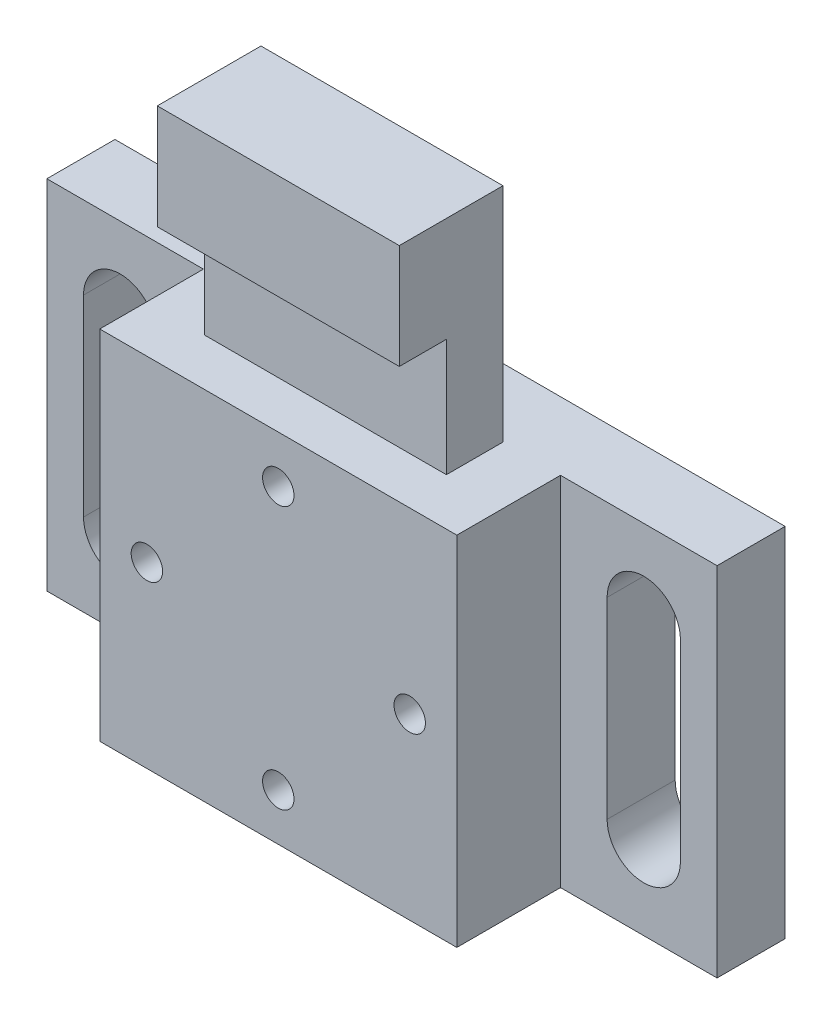
ISO-10303-21;
HEADER;
FILE_DESCRIPTION(('STEP AP214'),'2;1');
FILE_NAME('part.step','',(''),(''),'','','');
FILE_SCHEMA(('AUTOMOTIVE_DESIGN { 1 0 10303 214 1 1 1 1 }'));
ENDSEC;
DATA;
#1=APPLICATION_CONTEXT('core data for automotive mechanical design processes');
#2=APPLICATION_PROTOCOL_DEFINITION('international standard','automotive_design',2000,#1);
#3=PRODUCT_CONTEXT('',#1,'mechanical');
#4=PRODUCT('Part','Part','',(#3));
#5=PRODUCT_RELATED_PRODUCT_CATEGORY('part','',(#4));
#6=PRODUCT_DEFINITION_FORMATION('','',#4);
#7=PRODUCT_DEFINITION_CONTEXT('part definition',#1,'design');
#8=PRODUCT_DEFINITION('design','',#6,#7);
#9=PRODUCT_DEFINITION_SHAPE('','',#8);
#10=(LENGTH_UNIT() NAMED_UNIT(*) SI_UNIT(.MILLI.,.METRE.));
#11=(NAMED_UNIT(*) PLANE_ANGLE_UNIT() SI_UNIT($,.RADIAN.));
#12=(NAMED_UNIT(*) SI_UNIT($,.STERADIAN.) SOLID_ANGLE_UNIT());
#13=UNCERTAINTY_MEASURE_WITH_UNIT(LENGTH_MEASURE(1.E-05),#10,'distance_accuracy_value','');
#14=(GEOMETRIC_REPRESENTATION_CONTEXT(3) GLOBAL_UNCERTAINTY_ASSIGNED_CONTEXT((#13)) GLOBAL_UNIT_ASSIGNED_CONTEXT((#10,
#11,#12)) REPRESENTATION_CONTEXT('',''));
#15=CARTESIAN_POINT('',(0.,0.,0.));
#16=DIRECTION('',(0.,0.,1.));
#17=DIRECTION('',(1.,0.,0.));
#18=AXIS2_PLACEMENT_3D('',#15,#16,#17);
#19=CARTESIAN_POINT('',(0.,0.,16.4));
#20=DIRECTION('',(0.,0.,1.));
#21=DIRECTION('',(1.,0.,0.));
#22=AXIS2_PLACEMENT_3D('',#19,#20,#21);
#23=PLANE('',#22);
#24=CARTESIAN_POINT('',(-12.55,0.,16.4));
#25=DIRECTION('',(0.,0.,1.));
#26=DIRECTION('',(1.,0.,0.));
#27=AXIS2_PLACEMENT_3D('',#24,#25,#26);
#28=CIRCLE('',#27,1.5);
#29=CARTESIAN_POINT('',(-11.05,0.,16.4));
#30=VERTEX_POINT('',#29);
#31=EDGE_CURVE('E627',#30,#30,#28,.T.);
#32=ORIENTED_EDGE('',*,*,#31,.F.);
#33=EDGE_LOOP('',(#32));
#34=FACE_BOUND('',#33,.T.);
#35=DIRECTION('',(-1.,0.,0.));
#36=VECTOR('',#35,1.);
#37=CARTESIAN_POINT('',(11.555,17.05,16.4));
#38=LINE('',#37,#36);
#39=CARTESIAN_POINT('',(17.05,17.05,16.4));
#40=VERTEX_POINT('',#39);
#41=CARTESIAN_POINT('',(-17.05,17.05,16.4));
#42=VERTEX_POINT('',#41);
#43=EDGE_CURVE('E281',#40,#42,#38,.T.);
#44=ORIENTED_EDGE('',*,*,#43,.T.);
#45=DIRECTION('',(0.,-1.,0.));
#46=VECTOR('',#45,1.);
#47=CARTESIAN_POINT('',(-17.05,17.05,16.4));
#48=LINE('',#47,#46);
#49=CARTESIAN_POINT('',(-17.05,-17.05,16.4));
#50=VERTEX_POINT('',#49);
#51=EDGE_CURVE('E273',#42,#50,#48,.T.);
#52=ORIENTED_EDGE('',*,*,#51,.T.);
#53=DIRECTION('',(1.,0.,0.));
#54=VECTOR('',#53,1.);
#55=CARTESIAN_POINT('',(-17.05,-17.05,16.4));
#56=LINE('',#55,#54);
#57=CARTESIAN_POINT('',(17.05,-17.05,16.4));
#58=VERTEX_POINT('',#57);
#59=EDGE_CURVE('E276',#50,#58,#56,.T.);
#60=ORIENTED_EDGE('',*,*,#59,.T.);
#61=DIRECTION('',(0.,1.,0.));
#62=VECTOR('',#61,1.);
#63=CARTESIAN_POINT('',(17.05,17.05,16.4));
#64=LINE('',#63,#62);
#65=EDGE_CURVE('E279',#58,#40,#64,.T.);
#66=ORIENTED_EDGE('',*,*,#65,.T.);
#67=EDGE_LOOP('',(#44,#52,#60,#66));
#68=FACE_BOUND('',#67,.T.);
#69=CARTESIAN_POINT('',(0.,12.55,16.4));
#70=DIRECTION('',(0.,0.,1.));
#71=DIRECTION('',(1.,0.,0.));
#72=AXIS2_PLACEMENT_3D('',#69,#70,#71);
#73=CIRCLE('',#72,1.5);
#74=CARTESIAN_POINT('',(1.5,12.55,16.4));
#75=VERTEX_POINT('',#74);
#76=EDGE_CURVE('E643',#75,#75,#73,.T.);
#77=ORIENTED_EDGE('',*,*,#76,.F.);
#78=EDGE_LOOP('',(#77));
#79=FACE_BOUND('',#78,.T.);
#80=CARTESIAN_POINT('',(0.,-12.55,16.4));
#81=DIRECTION('',(0.,0.,1.));
#82=DIRECTION('',(1.,0.,0.));
#83=AXIS2_PLACEMENT_3D('',#80,#81,#82);
#84=CIRCLE('',#83,1.5);
#85=CARTESIAN_POINT('',(1.5,-12.55,16.4));
#86=VERTEX_POINT('',#85);
#87=EDGE_CURVE('E638',#86,#86,#84,.T.);
#88=ORIENTED_EDGE('',*,*,#87,.F.);
#89=EDGE_LOOP('',(#88));
#90=FACE_BOUND('',#89,.T.);
#91=CARTESIAN_POINT('',(12.55,0.,16.4));
#92=DIRECTION('',(0.,0.,-1.));
#93=DIRECTION('',(-1.,0.,0.));
#94=AXIS2_PLACEMENT_3D('',#91,#92,#93);
#95=CIRCLE('',#94,1.5);
#96=CARTESIAN_POINT('',(11.05,0.,16.4));
#97=VERTEX_POINT('',#96);
#98=EDGE_CURVE('E630',#97,#97,#95,.T.);
#99=ORIENTED_EDGE('',*,*,#98,.T.);
#100=EDGE_LOOP('',(#99));
#101=FACE_BOUND('',#100,.T.);
#102=ADVANCED_FACE('F36',(#34,#68,#79,#90,#101),#23,.T.);
#103=CARTESIAN_POINT('',(0.,0.,6.5));
#104=DIRECTION('',(0.,0.,1.));
#105=DIRECTION('',(1.,0.,0.));
#106=AXIS2_PLACEMENT_3D('',#103,#104,#105);
#107=PLANE('',#106);
#108=DIRECTION('',(0.,1.,0.));
#109=VECTOR('',#108,1.);
#110=CARTESIAN_POINT('',(17.05,17.05,6.5));
#111=LINE('',#110,#109);
#112=CARTESIAN_POINT('',(17.05,-17.05,6.5));
#113=VERTEX_POINT('',#112);
#114=CARTESIAN_POINT('',(17.05,17.05,6.5));
#115=VERTEX_POINT('',#114);
#116=EDGE_CURVE('E293',#113,#115,#111,.T.);
#117=ORIENTED_EDGE('',*,*,#116,.F.);
#118=DIRECTION('',(1.,0.,0.));
#119=VECTOR('',#118,1.);
#120=CARTESIAN_POINT('',(-32.,-17.05,6.5));
#121=LINE('',#120,#119);
#122=CARTESIAN_POINT('',(32.,-17.05,6.5));
#123=VERTEX_POINT('',#122);
#124=EDGE_CURVE('E327',#113,#123,#121,.T.);
#125=ORIENTED_EDGE('',*,*,#124,.T.);
#126=DIRECTION('',(0.,1.,0.));
#127=VECTOR('',#126,1.);
#128=CARTESIAN_POINT('',(32.,17.05,6.5));
#129=LINE('',#128,#127);
#130=CARTESIAN_POINT('',(32.,17.05,6.5));
#131=VERTEX_POINT('',#130);
#132=EDGE_CURVE('E331',#123,#131,#129,.T.);
#133=ORIENTED_EDGE('',*,*,#132,.T.);
#134=DIRECTION('',(-1.,0.,0.));
#135=VECTOR('',#134,1.);
#136=CARTESIAN_POINT('',(-32.,17.05,6.5));
#137=LINE('',#136,#135);
#138=EDGE_CURVE('E334',#131,#115,#137,.T.);
#139=ORIENTED_EDGE('',*,*,#138,.T.);
#140=EDGE_LOOP('',(#117,#125,#133,#139));
#141=FACE_BOUND('',#140,.T.);
#142=DIRECTION('',(0.,1.,0.));
#143=VECTOR('',#142,1.);
#144=CARTESIAN_POINT('',(21.5,9.17868157946697,6.5));
#145=LINE('',#144,#143);
#146=CARTESIAN_POINT('',(21.5,-9.17868157946697,6.5));
#147=VERTEX_POINT('',#146);
#148=CARTESIAN_POINT('',(21.5,9.17868157946697,6.5));
#149=VERTEX_POINT('',#148);
#150=EDGE_CURVE('E213',#147,#149,#145,.T.);
#151=ORIENTED_EDGE('',*,*,#150,.T.);
#152=CARTESIAN_POINT('',(25.,9.17868157946697,6.5));
#153=DIRECTION('',(0.,0.,-1.));
#154=DIRECTION('',(-1.,0.,0.));
#155=AXIS2_PLACEMENT_3D('',#152,#153,#154);
#156=CIRCLE('',#155,3.5);
#157=CARTESIAN_POINT('',(28.5,9.17868157946697,6.5));
#158=VERTEX_POINT('',#157);
#159=EDGE_CURVE('E51',#149,#158,#156,.T.);
#160=ORIENTED_EDGE('',*,*,#159,.T.);
#161=DIRECTION('',(0.,-1.,0.));
#162=VECTOR('',#161,1.);
#163=CARTESIAN_POINT('',(28.5,9.17868157946697,6.5));
#164=LINE('',#163,#162);
#165=CARTESIAN_POINT('',(28.5,-9.17868157946697,6.5));
#166=VERTEX_POINT('',#165);
#167=EDGE_CURVE('E201',#158,#166,#164,.T.);
#168=ORIENTED_EDGE('',*,*,#167,.T.);
#169=CARTESIAN_POINT('',(25.,-9.17868157946697,6.5));
#170=DIRECTION('',(0.,0.,-1.));
#171=DIRECTION('',(-1.,0.,0.));
#172=AXIS2_PLACEMENT_3D('',#169,#170,#171);
#173=CIRCLE('',#172,3.5);
#174=EDGE_CURVE('E204',#166,#147,#173,.T.);
#175=ORIENTED_EDGE('',*,*,#174,.T.);
#176=EDGE_LOOP('',(#151,#160,#168,#175));
#177=FACE_BOUND('',#176,.T.);
#178=ADVANCED_FACE('F416',(#141,#177),#107,.T.);
#179=CARTESIAN_POINT('',(0.,0.,0.));
#180=DIRECTION('',(0.,0.,1.));
#181=DIRECTION('',(1.,0.,0.));
#182=AXIS2_PLACEMENT_3D('',#179,#180,#181);
#183=PLANE('',#182);
#184=DIRECTION('',(0.,-1.,0.));
#185=VECTOR('',#184,1.);
#186=CARTESIAN_POINT('',(-32.,17.05,0.));
#187=LINE('',#186,#185);
#188=CARTESIAN_POINT('',(-32.,17.05,0.));
#189=VERTEX_POINT('',#188);
#190=CARTESIAN_POINT('',(-32.,-17.05,0.));
#191=VERTEX_POINT('',#190);
#192=EDGE_CURVE('E323',#189,#191,#187,.T.);
#193=ORIENTED_EDGE('',*,*,#192,.F.);
#194=DIRECTION('',(-1.,0.,0.));
#195=VECTOR('',#194,1.);
#196=CARTESIAN_POINT('',(-32.,17.05,0.));
#197=LINE('',#196,#195);
#198=CARTESIAN_POINT('',(32.,17.05,0.));
#199=VERTEX_POINT('',#198);
#200=EDGE_CURVE('E328',#199,#189,#197,.T.);
#201=ORIENTED_EDGE('',*,*,#200,.F.);
#202=DIRECTION('',(0.,1.,0.));
#203=VECTOR('',#202,1.);
#204=CARTESIAN_POINT('',(32.,17.05,0.));
#205=LINE('',#204,#203);
#206=CARTESIAN_POINT('',(32.,-17.05,0.));
#207=VERTEX_POINT('',#206);
#208=EDGE_CURVE('E342',#207,#199,#205,.T.);
#209=ORIENTED_EDGE('',*,*,#208,.F.);
#210=DIRECTION('',(1.,0.,0.));
#211=VECTOR('',#210,1.);
#212=CARTESIAN_POINT('',(-32.,-17.05,0.));
#213=LINE('',#212,#211);
#214=EDGE_CURVE('E340',#191,#207,#213,.T.);
#215=ORIENTED_EDGE('',*,*,#214,.F.);
#216=EDGE_LOOP('',(#193,#201,#209,#215));
#217=FACE_BOUND('',#216,.T.);
#218=DIRECTION('',(0.,1.,0.));
#219=VECTOR('',#218,1.);
#220=CARTESIAN_POINT('',(-21.5,9.17868157946697,0.));
#221=LINE('',#220,#219);
#222=CARTESIAN_POINT('',(-21.5,-9.17868157946697,0.));
#223=VERTEX_POINT('',#222);
#224=CARTESIAN_POINT('',(-21.5,9.17868157946697,0.));
#225=VERTEX_POINT('',#224);
#226=EDGE_CURVE('E234',#223,#225,#221,.T.);
#227=ORIENTED_EDGE('',*,*,#226,.T.);
#228=CARTESIAN_POINT('',(-25.,9.17868157946697,0.));
#229=DIRECTION('',(0.,0.,1.));
#230=DIRECTION('',(1.,0.,0.));
#231=AXIS2_PLACEMENT_3D('',#228,#229,#230);
#232=CIRCLE('',#231,3.5);
#233=CARTESIAN_POINT('',(-28.5,9.17868157946697,0.));
#234=VERTEX_POINT('',#233);
#235=EDGE_CURVE('E224',#225,#234,#232,.T.);
#236=ORIENTED_EDGE('',*,*,#235,.T.);
#237=DIRECTION('',(0.,-1.,0.));
#238=VECTOR('',#237,1.);
#239=CARTESIAN_POINT('',(-28.5,9.17868157946697,0.));
#240=LINE('',#239,#238);
#241=CARTESIAN_POINT('',(-28.5,-9.17868157946697,0.));
#242=VERTEX_POINT('',#241);
#243=EDGE_CURVE('E227',#234,#242,#240,.T.);
#244=ORIENTED_EDGE('',*,*,#243,.T.);
#245=CARTESIAN_POINT('',(-25.,-9.17868157946697,0.));
#246=DIRECTION('',(0.,0.,1.));
#247=DIRECTION('',(1.,0.,0.));
#248=AXIS2_PLACEMENT_3D('',#245,#246,#247);
#249=CIRCLE('',#248,3.5);
#250=EDGE_CURVE('E231',#242,#223,#249,.T.);
#251=ORIENTED_EDGE('',*,*,#250,.T.);
#252=EDGE_LOOP('',(#227,#236,#244,#251));
#253=FACE_BOUND('',#252,.T.);
#254=CARTESIAN_POINT('',(25.,9.17868157946697,0.));
#255=DIRECTION('',(0.,0.,-1.));
#256=DIRECTION('',(-1.,0.,0.));
#257=AXIS2_PLACEMENT_3D('',#254,#255,#256);
#258=CIRCLE('',#257,3.5);
#259=CARTESIAN_POINT('',(21.5,9.17868157946697,0.));
#260=VERTEX_POINT('',#259);
#261=CARTESIAN_POINT('',(28.5,9.17868157946697,0.));
#262=VERTEX_POINT('',#261);
#263=EDGE_CURVE('E193',#260,#262,#258,.T.);
#264=ORIENTED_EDGE('',*,*,#263,.F.);
#265=DIRECTION('',(0.,1.,0.));
#266=VECTOR('',#265,1.);
#267=CARTESIAN_POINT('',(21.5,9.17868157946697,0.));
#268=LINE('',#267,#266);
#269=CARTESIAN_POINT('',(21.5,-9.17868157946697,0.));
#270=VERTEX_POINT('',#269);
#271=EDGE_CURVE('E185',#270,#260,#268,.T.);
#272=ORIENTED_EDGE('',*,*,#271,.F.);
#273=CARTESIAN_POINT('',(25.,-9.17868157946697,0.));
#274=DIRECTION('',(0.,0.,-1.));
#275=DIRECTION('',(-1.,0.,0.));
#276=AXIS2_PLACEMENT_3D('',#273,#274,#275);
#277=CIRCLE('',#276,3.5);
#278=CARTESIAN_POINT('',(28.5,-9.17868157946697,0.));
#279=VERTEX_POINT('',#278);
#280=EDGE_CURVE('E192',#279,#270,#277,.T.);
#281=ORIENTED_EDGE('',*,*,#280,.F.);
#282=DIRECTION('',(0.,-1.,0.));
#283=VECTOR('',#282,1.);
#284=CARTESIAN_POINT('',(28.5,9.17868157946697,0.));
#285=LINE('',#284,#283);
#286=EDGE_CURVE('E197',#262,#279,#285,.T.);
#287=ORIENTED_EDGE('',*,*,#286,.F.);
#288=EDGE_LOOP('',(#264,#272,#281,#287));
#289=FACE_BOUND('',#288,.T.);
#290=ADVANCED_FACE('F200',(#217,#253,#289),#183,.F.);
#291=DIRECTION('',(-1.,0.,0.));
#292=VECTOR('',#291,1.);
#293=CARTESIAN_POINT('',(-11.555,28.25,16.4));
#294=LINE('',#293,#292);
#295=CARTESIAN_POINT('',(11.555,28.25,16.4));
#296=VERTEX_POINT('',#295);
#297=CARTESIAN_POINT('',(-11.555,28.25,16.4));
#298=VERTEX_POINT('',#297);
#299=EDGE_CURVE('E249',#296,#298,#294,.T.);
#300=ORIENTED_EDGE('',*,*,#299,.F.);
#301=DIRECTION('',(0.,1.,0.));
#302=VECTOR('',#301,1.);
#303=CARTESIAN_POINT('',(11.555,17.05,16.4));
#304=LINE('',#303,#302);
#305=CARTESIAN_POINT('',(11.555,38.25,16.4));
#306=VERTEX_POINT('',#305);
#307=EDGE_CURVE('E283',#296,#306,#304,.T.);
#308=ORIENTED_EDGE('',*,*,#307,.T.);
#309=DIRECTION('',(-1.,0.,0.));
#310=VECTOR('',#309,1.);
#311=CARTESIAN_POINT('',(-11.555,38.25,16.4));
#312=LINE('',#311,#310);
#313=CARTESIAN_POINT('',(-11.555,38.25,16.4));
#314=VERTEX_POINT('',#313);
#315=EDGE_CURVE('E285',#306,#314,#312,.T.);
#316=ORIENTED_EDGE('',*,*,#315,.T.);
#317=DIRECTION('',(0.,-1.,0.));
#318=VECTOR('',#317,1.);
#319=CARTESIAN_POINT('',(-11.555,17.05,16.4));
#320=LINE('',#319,#318);
#321=EDGE_CURVE('E287',#314,#298,#320,.T.);
#322=ORIENTED_EDGE('',*,*,#321,.T.);
#323=EDGE_LOOP('',(#300,#308,#316,#322));
#324=FACE_BOUND('',#323,.T.);
#325=ADVANCED_FACE('F403',(#324),#23,.T.);
#326=CARTESIAN_POINT('',(-25.,9.17868157946697,6.5));
#327=DIRECTION('',(0.,0.,1.));
#328=DIRECTION('',(1.,0.,0.));
#329=AXIS2_PLACEMENT_3D('',#326,#327,#328);
#330=CIRCLE('',#329,3.5);
#331=CARTESIAN_POINT('',(-21.5,9.17868157946697,6.5));
#332=VERTEX_POINT('',#331);
#333=CARTESIAN_POINT('',(-28.5,9.17868157946697,6.5));
#334=VERTEX_POINT('',#333);
#335=EDGE_CURVE('E220',#332,#334,#330,.T.);
#336=ORIENTED_EDGE('',*,*,#335,.F.);
#337=DIRECTION('',(0.,1.,0.));
#338=VECTOR('',#337,1.);
#339=CARTESIAN_POINT('',(-21.5,9.17868157946697,6.5));
#340=LINE('',#339,#338);
#341=CARTESIAN_POINT('',(-21.5,-9.17868157946697,6.5));
#342=VERTEX_POINT('',#341);
#343=EDGE_CURVE('E228',#342,#332,#340,.T.);
#344=ORIENTED_EDGE('',*,*,#343,.F.);
#345=CARTESIAN_POINT('',(-25.,-9.17868157946697,6.5));
#346=DIRECTION('',(0.,0.,1.));
#347=DIRECTION('',(1.,0.,0.));
#348=AXIS2_PLACEMENT_3D('',#345,#346,#347);
#349=CIRCLE('',#348,3.5);
#350=CARTESIAN_POINT('',(-28.5,-9.17868157946697,6.5));
#351=VERTEX_POINT('',#350);
#352=EDGE_CURVE('E242',#351,#342,#349,.T.);
#353=ORIENTED_EDGE('',*,*,#352,.F.);
#354=DIRECTION('',(0.,-1.,0.));
#355=VECTOR('',#354,1.);
#356=CARTESIAN_POINT('',(-28.5,9.17868157946697,6.5));
#357=LINE('',#356,#355);
#358=EDGE_CURVE('E239',#334,#351,#357,.T.);
#359=ORIENTED_EDGE('',*,*,#358,.F.);
#360=EDGE_LOOP('',(#336,#344,#353,#359));
#361=FACE_BOUND('',#360,.T.);
#362=DIRECTION('',(0.,-1.,0.));
#363=VECTOR('',#362,1.);
#364=CARTESIAN_POINT('',(-17.05,17.05,6.5));
#365=LINE('',#364,#363);
#366=CARTESIAN_POINT('',(-17.05,17.05,6.5));
#367=VERTEX_POINT('',#366);
#368=CARTESIAN_POINT('',(-17.05,-17.05,6.5));
#369=VERTEX_POINT('',#368);
#370=EDGE_CURVE('E271',#367,#369,#365,.T.);
#371=ORIENTED_EDGE('',*,*,#370,.F.);
#372=CARTESIAN_POINT('',(-32.,17.05,6.5));
#373=VERTEX_POINT('',#372);
#374=EDGE_CURVE('E333',#367,#373,#137,.T.);
#375=ORIENTED_EDGE('',*,*,#374,.T.);
#376=DIRECTION('',(0.,-1.,0.));
#377=VECTOR('',#376,1.);
#378=CARTESIAN_POINT('',(-32.,17.05,6.5));
#379=LINE('',#378,#377);
#380=CARTESIAN_POINT('',(-32.,-17.05,6.5));
#381=VERTEX_POINT('',#380);
#382=EDGE_CURVE('E324',#373,#381,#379,.T.);
#383=ORIENTED_EDGE('',*,*,#382,.T.);
#384=EDGE_CURVE('E329',#381,#369,#121,.T.);
#385=ORIENTED_EDGE('',*,*,#384,.T.);
#386=EDGE_LOOP('',(#371,#375,#383,#385));
#387=FACE_BOUND('',#386,.T.);
#388=ADVANCED_FACE('F371',(#361,#387),#107,.T.);
#389=CARTESIAN_POINT('',(-32.,17.05,6.5));
#390=DIRECTION('',(1.,0.,0.));
#391=DIRECTION('',(0.,0.,-1.));
#392=AXIS2_PLACEMENT_3D('',#389,#390,#391);
#393=PLANE('',#392);
#394=ORIENTED_EDGE('',*,*,#192,.T.);
#395=DIRECTION('',(0.,0.,-1.));
#396=VECTOR('',#395,1.);
#397=CARTESIAN_POINT('',(-32.,-17.05,6.5));
#398=LINE('',#397,#396);
#399=EDGE_CURVE('E11',#381,#191,#398,.T.);
#400=ORIENTED_EDGE('',*,*,#399,.F.);
#401=ORIENTED_EDGE('',*,*,#382,.F.);
#402=DIRECTION('',(0.,0.,-1.));
#403=VECTOR('',#402,1.);
#404=CARTESIAN_POINT('',(-32.,17.05,6.5));
#405=LINE('',#404,#403);
#406=EDGE_CURVE('E336',#373,#189,#405,.T.);
#407=ORIENTED_EDGE('',*,*,#406,.T.);
#408=EDGE_LOOP('',(#394,#400,#401,#407));
#409=FACE_BOUND('',#408,.T.);
#410=ADVANCED_FACE('F38',(#409),#393,.F.);
#411=CARTESIAN_POINT('',(-32.,-17.05,6.5));
#412=DIRECTION('',(0.,1.,0.));
#413=DIRECTION('',(0.,0.,1.));
#414=AXIS2_PLACEMENT_3D('',#411,#412,#413);
#415=PLANE('',#414);
#416=ORIENTED_EDGE('',*,*,#214,.T.);
#417=DIRECTION('',(0.,0.,-1.));
#418=VECTOR('',#417,1.);
#419=CARTESIAN_POINT('',(32.,-17.05,6.5));
#420=LINE('',#419,#418);
#421=EDGE_CURVE('E44',#123,#207,#420,.T.);
#422=ORIENTED_EDGE('',*,*,#421,.F.);
#423=ORIENTED_EDGE('',*,*,#124,.F.);
#424=DIRECTION('',(0.,0.,-1.));
#425=VECTOR('',#424,1.);
#426=CARTESIAN_POINT('',(17.05,-17.05,16.4));
#427=LINE('',#426,#425);
#428=EDGE_CURVE('E317',#58,#113,#427,.T.);
#429=ORIENTED_EDGE('',*,*,#428,.F.);
#430=ORIENTED_EDGE('',*,*,#59,.F.);
#431=DIRECTION('',(0.,0.,-1.));
#432=VECTOR('',#431,1.);
#433=CARTESIAN_POINT('',(-17.05,-17.05,16.4));
#434=LINE('',#433,#432);
#435=EDGE_CURVE('E320',#50,#369,#434,.T.);
#436=ORIENTED_EDGE('',*,*,#435,.T.);
#437=ORIENTED_EDGE('',*,*,#384,.F.);
#438=ORIENTED_EDGE('',*,*,#399,.T.);
#439=EDGE_LOOP('',(#416,#422,#423,#429,#430,#436,#437,#438));
#440=FACE_BOUND('',#439,.T.);
#441=ADVANCED_FACE('F440',(#440),#415,.F.);
#442=CARTESIAN_POINT('',(32.,17.05,6.5));
#443=DIRECTION('',(-1.,0.,0.));
#444=DIRECTION('',(0.,0.,1.));
#445=AXIS2_PLACEMENT_3D('',#442,#443,#444);
#446=PLANE('',#445);
#447=ORIENTED_EDGE('',*,*,#208,.T.);
#448=DIRECTION('',(0.,0.,-1.));
#449=VECTOR('',#448,1.);
#450=CARTESIAN_POINT('',(32.,17.05,6.5));
#451=LINE('',#450,#449);
#452=EDGE_CURVE('E347',#131,#199,#451,.T.);
#453=ORIENTED_EDGE('',*,*,#452,.F.);
#454=ORIENTED_EDGE('',*,*,#132,.F.);
#455=ORIENTED_EDGE('',*,*,#421,.T.);
#456=EDGE_LOOP('',(#447,#453,#454,#455));
#457=FACE_BOUND('',#456,.T.);
#458=ADVANCED_FACE('F354',(#457),#446,.F.);
#459=CARTESIAN_POINT('',(-32.,17.05,6.5));
#460=DIRECTION('',(0.,-1.,0.));
#461=DIRECTION('',(0.,0.,-1.));
#462=AXIS2_PLACEMENT_3D('',#459,#460,#461);
#463=PLANE('',#462);
#464=DIRECTION('',(0.,0.,-1.));
#465=VECTOR('',#464,1.);
#466=CARTESIAN_POINT('',(11.555,17.05,16.4));
#467=LINE('',#466,#465);
#468=CARTESIAN_POINT('',(11.555,17.05,11.9));
#469=VERTEX_POINT('',#468);
#470=CARTESIAN_POINT('',(11.555,17.05,6.5));
#471=VERTEX_POINT('',#470);
#472=EDGE_CURVE('E312',#469,#471,#467,.T.);
#473=ORIENTED_EDGE('',*,*,#472,.F.);
#474=DIRECTION('',(1.,0.,0.));
#475=VECTOR('',#474,1.);
#476=CARTESIAN_POINT('',(-11.555,17.05,11.9));
#477=LINE('',#476,#475);
#478=CARTESIAN_POINT('',(-11.555,17.05,11.9));
#479=VERTEX_POINT('',#478);
#480=EDGE_CURVE('E259',#479,#469,#477,.T.);
#481=ORIENTED_EDGE('',*,*,#480,.F.);
#482=DIRECTION('',(0.,0.,-1.));
#483=VECTOR('',#482,1.);
#484=CARTESIAN_POINT('',(-11.555,17.05,16.4));
#485=LINE('',#484,#483);
#486=CARTESIAN_POINT('',(-11.555,17.05,6.5));
#487=VERTEX_POINT('',#486);
#488=EDGE_CURVE('E304',#479,#487,#485,.T.);
#489=ORIENTED_EDGE('',*,*,#488,.T.);
#490=EDGE_CURVE('E337',#471,#487,#137,.T.);
#491=ORIENTED_EDGE('',*,*,#490,.F.);
#492=EDGE_LOOP('',(#473,#481,#489,#491));
#493=FACE_BOUND('',#492,.T.);
#494=ORIENTED_EDGE('',*,*,#200,.T.);
#495=ORIENTED_EDGE('',*,*,#406,.F.);
#496=ORIENTED_EDGE('',*,*,#374,.F.);
#497=DIRECTION('',(0.,0.,-1.));
#498=VECTOR('',#497,1.);
#499=CARTESIAN_POINT('',(-17.05,17.05,16.4));
#500=LINE('',#499,#498);
#501=EDGE_CURVE('E290',#42,#367,#500,.T.);
#502=ORIENTED_EDGE('',*,*,#501,.F.);
#503=ORIENTED_EDGE('',*,*,#43,.F.);
#504=DIRECTION('',(0.,0.,-1.));
#505=VECTOR('',#504,1.);
#506=CARTESIAN_POINT('',(17.05,17.05,16.4));
#507=LINE('',#506,#505);
#508=EDGE_CURVE('E314',#40,#115,#507,.T.);
#509=ORIENTED_EDGE('',*,*,#508,.T.);
#510=ORIENTED_EDGE('',*,*,#138,.F.);
#511=ORIENTED_EDGE('',*,*,#452,.T.);
#512=EDGE_LOOP('',(#494,#495,#496,#502,#503,#509,#510,#511));
#513=FACE_BOUND('',#512,.T.);
#514=ADVANCED_FACE('F364',(#493,#513),#463,.F.);
#515=CARTESIAN_POINT('',(0.,0.,6.5));
#516=DIRECTION('',(0.,0.,1.));
#517=DIRECTION('',(1.,0.,0.));
#518=AXIS2_PLACEMENT_3D('',#515,#516,#517);
#519=PLANE('',#518);
#520=DIRECTION('',(0.,1.,0.));
#521=VECTOR('',#520,1.);
#522=CARTESIAN_POINT('',(11.555,17.05,6.5));
#523=LINE('',#522,#521);
#524=CARTESIAN_POINT('',(11.555,38.25,6.5));
#525=VERTEX_POINT('',#524);
#526=EDGE_CURVE('E296',#471,#525,#523,.T.);
#527=ORIENTED_EDGE('',*,*,#526,.F.);
#528=ORIENTED_EDGE('',*,*,#490,.T.);
#529=DIRECTION('',(0.,-1.,0.));
#530=VECTOR('',#529,1.);
#531=CARTESIAN_POINT('',(-11.555,17.05,6.5));
#532=LINE('',#531,#530);
#533=CARTESIAN_POINT('',(-11.555,38.25,6.5));
#534=VERTEX_POINT('',#533);
#535=EDGE_CURVE('E277',#534,#487,#532,.T.);
#536=ORIENTED_EDGE('',*,*,#535,.F.);
#537=DIRECTION('',(-1.,0.,0.));
#538=VECTOR('',#537,1.);
#539=CARTESIAN_POINT('',(-11.555,38.25,6.5));
#540=LINE('',#539,#538);
#541=EDGE_CURVE('E298',#525,#534,#540,.T.);
#542=ORIENTED_EDGE('',*,*,#541,.F.);
#543=EDGE_LOOP('',(#527,#528,#536,#542));
#544=FACE_BOUND('',#543,.T.);
#545=ADVANCED_FACE('F378',(#544),#519,.F.);
#546=CARTESIAN_POINT('',(-17.05,17.05,16.4));
#547=DIRECTION('',(1.,0.,0.));
#548=DIRECTION('',(0.,1.,0.));
#549=AXIS2_PLACEMENT_3D('',#546,#547,#548);
#550=PLANE('',#549);
#551=ORIENTED_EDGE('',*,*,#370,.T.);
#552=ORIENTED_EDGE('',*,*,#435,.F.);
#553=ORIENTED_EDGE('',*,*,#51,.F.);
#554=ORIENTED_EDGE('',*,*,#501,.T.);
#555=EDGE_LOOP('',(#551,#552,#553,#554));
#556=FACE_BOUND('',#555,.T.);
#557=ADVANCED_FACE('F449',(#556),#550,.F.);
#558=CARTESIAN_POINT('',(17.05,17.05,16.4));
#559=DIRECTION('',(-1.,0.,0.));
#560=DIRECTION('',(0.,-1.,0.));
#561=AXIS2_PLACEMENT_3D('',#558,#559,#560);
#562=PLANE('',#561);
#563=ORIENTED_EDGE('',*,*,#116,.T.);
#564=ORIENTED_EDGE('',*,*,#508,.F.);
#565=ORIENTED_EDGE('',*,*,#65,.F.);
#566=ORIENTED_EDGE('',*,*,#428,.T.);
#567=EDGE_LOOP('',(#563,#564,#565,#566));
#568=FACE_BOUND('',#567,.T.);
#569=ADVANCED_FACE('F455',(#568),#562,.F.);
#570=CARTESIAN_POINT('',(11.555,17.05,16.4));
#571=DIRECTION('',(-1.,0.,0.));
#572=DIRECTION('',(0.,0.,1.));
#573=AXIS2_PLACEMENT_3D('',#570,#571,#572);
#574=PLANE('',#573);
#575=ORIENTED_EDGE('',*,*,#307,.F.);
#576=DIRECTION('',(0.,0.,1.));
#577=VECTOR('',#576,1.);
#578=CARTESIAN_POINT('',(11.555,28.25,11.9));
#579=LINE('',#578,#577);
#580=CARTESIAN_POINT('',(11.555,28.25,11.9));
#581=VERTEX_POINT('',#580);
#582=EDGE_CURVE('E266',#581,#296,#579,.T.);
#583=ORIENTED_EDGE('',*,*,#582,.F.);
#584=DIRECTION('',(0.,1.,0.));
#585=VECTOR('',#584,1.);
#586=CARTESIAN_POINT('',(11.555,17.05,11.9));
#587=LINE('',#586,#585);
#588=EDGE_CURVE('E261',#469,#581,#587,.T.);
#589=ORIENTED_EDGE('',*,*,#588,.F.);
#590=ORIENTED_EDGE('',*,*,#472,.T.);
#591=ORIENTED_EDGE('',*,*,#526,.T.);
#592=DIRECTION('',(0.,0.,-1.));
#593=VECTOR('',#592,1.);
#594=CARTESIAN_POINT('',(11.555,38.25,16.4));
#595=LINE('',#594,#593);
#596=EDGE_CURVE('E309',#306,#525,#595,.T.);
#597=ORIENTED_EDGE('',*,*,#596,.F.);
#598=EDGE_LOOP('',(#575,#583,#589,#590,#591,#597));
#599=FACE_BOUND('',#598,.T.);
#600=ADVANCED_FACE('F394',(#599),#574,.F.);
#601=CARTESIAN_POINT('',(-11.555,38.25,16.4));
#602=DIRECTION('',(0.,-1.,0.));
#603=DIRECTION('',(0.,0.,-1.));
#604=AXIS2_PLACEMENT_3D('',#601,#602,#603);
#605=PLANE('',#604);
#606=ORIENTED_EDGE('',*,*,#541,.T.);
#607=DIRECTION('',(0.,0.,-1.));
#608=VECTOR('',#607,1.);
#609=CARTESIAN_POINT('',(-11.555,38.25,16.4));
#610=LINE('',#609,#608);
#611=EDGE_CURVE('E306',#314,#534,#610,.T.);
#612=ORIENTED_EDGE('',*,*,#611,.F.);
#613=ORIENTED_EDGE('',*,*,#315,.F.);
#614=ORIENTED_EDGE('',*,*,#596,.T.);
#615=EDGE_LOOP('',(#606,#612,#613,#614));
#616=FACE_BOUND('',#615,.T.);
#617=ADVANCED_FACE('F390',(#616),#605,.F.);
#618=CARTESIAN_POINT('',(-11.555,17.05,16.4));
#619=DIRECTION('',(1.,0.,0.));
#620=DIRECTION('',(0.,0.,-1.));
#621=AXIS2_PLACEMENT_3D('',#618,#619,#620);
#622=PLANE('',#621);
#623=DIRECTION('',(0.,-1.,0.));
#624=VECTOR('',#623,1.);
#625=CARTESIAN_POINT('',(-11.555,17.05,11.9));
#626=LINE('',#625,#624);
#627=CARTESIAN_POINT('',(-11.555,28.25,11.9));
#628=VERTEX_POINT('',#627);
#629=EDGE_CURVE('E256',#628,#479,#626,.T.);
#630=ORIENTED_EDGE('',*,*,#629,.F.);
#631=DIRECTION('',(0.,0.,1.));
#632=VECTOR('',#631,1.);
#633=CARTESIAN_POINT('',(-11.555,28.25,11.9));
#634=LINE('',#633,#632);
#635=EDGE_CURVE('E268',#628,#298,#634,.T.);
#636=ORIENTED_EDGE('',*,*,#635,.T.);
#637=ORIENTED_EDGE('',*,*,#321,.F.);
#638=ORIENTED_EDGE('',*,*,#611,.T.);
#639=ORIENTED_EDGE('',*,*,#535,.T.);
#640=ORIENTED_EDGE('',*,*,#488,.F.);
#641=EDGE_LOOP('',(#630,#636,#637,#638,#639,#640));
#642=FACE_BOUND('',#641,.T.);
#643=ADVANCED_FACE('F385',(#642),#622,.F.);
#644=CARTESIAN_POINT('',(-11.555,28.25,11.9));
#645=DIRECTION('',(0.,1.,0.));
#646=DIRECTION('',(0.,0.,1.));
#647=AXIS2_PLACEMENT_3D('',#644,#645,#646);
#648=PLANE('',#647);
#649=ORIENTED_EDGE('',*,*,#299,.T.);
#650=ORIENTED_EDGE('',*,*,#635,.F.);
#651=DIRECTION('',(-1.,0.,0.));
#652=VECTOR('',#651,1.);
#653=CARTESIAN_POINT('',(-11.555,28.25,11.9));
#654=LINE('',#653,#652);
#655=EDGE_CURVE('E263',#581,#628,#654,.T.);
#656=ORIENTED_EDGE('',*,*,#655,.F.);
#657=ORIENTED_EDGE('',*,*,#582,.T.);
#658=EDGE_LOOP('',(#649,#650,#656,#657));
#659=FACE_BOUND('',#658,.T.);
#660=ADVANCED_FACE('F404',(#659),#648,.F.);
#661=CARTESIAN_POINT('',(0.,0.,11.9));
#662=DIRECTION('',(0.,0.,-1.));
#663=DIRECTION('',(-1.,0.,0.));
#664=AXIS2_PLACEMENT_3D('',#661,#662,#663);
#665=PLANE('',#664);
#666=ORIENTED_EDGE('',*,*,#629,.T.);
#667=ORIENTED_EDGE('',*,*,#480,.T.);
#668=ORIENTED_EDGE('',*,*,#588,.T.);
#669=ORIENTED_EDGE('',*,*,#655,.T.);
#670=EDGE_LOOP('',(#666,#667,#668,#669));
#671=FACE_BOUND('',#670,.T.);
#672=ADVANCED_FACE('F398',(#671),#665,.F.);
#673=CARTESIAN_POINT('',(-25.,9.17868157946697,0.));
#674=DIRECTION('',(0.,0.,1.));
#675=DIRECTION('',(1.,0.,0.));
#676=AXIS2_PLACEMENT_3D('',#673,#674,#675);
#677=CYLINDRICAL_SURFACE('',#676,3.5);
#678=ORIENTED_EDGE('',*,*,#335,.T.);
#679=DIRECTION('',(0.,0.,1.));
#680=VECTOR('',#679,1.);
#681=CARTESIAN_POINT('',(-28.5,9.17868157946697,0.));
#682=LINE('',#681,#680);
#683=EDGE_CURVE('E237',#234,#334,#682,.T.);
#684=ORIENTED_EDGE('',*,*,#683,.F.);
#685=ORIENTED_EDGE('',*,*,#235,.F.);
#686=DIRECTION('',(0.,0.,1.));
#687=VECTOR('',#686,1.);
#688=CARTESIAN_POINT('',(-21.5,9.17868157946697,0.));
#689=LINE('',#688,#687);
#690=EDGE_CURVE('E247',#225,#332,#689,.T.);
#691=ORIENTED_EDGE('',*,*,#690,.T.);
#692=EDGE_LOOP('',(#678,#684,#685,#691));
#693=FACE_BOUND('',#692,.T.);
#694=ADVANCED_FACE('F411',(#693),#677,.F.);
#695=CARTESIAN_POINT('',(-21.5,9.17868157946697,0.));
#696=DIRECTION('',(1.,0.,0.));
#697=DIRECTION('',(0.,0.,-1.));
#698=AXIS2_PLACEMENT_3D('',#695,#696,#697);
#699=PLANE('',#698);
#700=ORIENTED_EDGE('',*,*,#343,.T.);
#701=ORIENTED_EDGE('',*,*,#690,.F.);
#702=ORIENTED_EDGE('',*,*,#226,.F.);
#703=DIRECTION('',(0.,0.,1.));
#704=VECTOR('',#703,1.);
#705=CARTESIAN_POINT('',(-21.5,-9.17868157946697,0.));
#706=LINE('',#705,#704);
#707=EDGE_CURVE('E250',#223,#342,#706,.T.);
#708=ORIENTED_EDGE('',*,*,#707,.T.);
#709=EDGE_LOOP('',(#700,#701,#702,#708));
#710=FACE_BOUND('',#709,.T.);
#711=ADVANCED_FACE('F479',(#710),#699,.F.);
#712=CARTESIAN_POINT('',(-25.,-9.17868157946697,0.));
#713=DIRECTION('',(0.,0.,1.));
#714=DIRECTION('',(1.,0.,0.));
#715=AXIS2_PLACEMENT_3D('',#712,#713,#714);
#716=CYLINDRICAL_SURFACE('',#715,3.5);
#717=ORIENTED_EDGE('',*,*,#352,.T.);
#718=ORIENTED_EDGE('',*,*,#707,.F.);
#719=ORIENTED_EDGE('',*,*,#250,.F.);
#720=DIRECTION('',(0.,0.,1.));
#721=VECTOR('',#720,1.);
#722=CARTESIAN_POINT('',(-28.5,-9.17868157946697,0.));
#723=LINE('',#722,#721);
#724=EDGE_CURVE('E252',#242,#351,#723,.T.);
#725=ORIENTED_EDGE('',*,*,#724,.T.);
#726=EDGE_LOOP('',(#717,#718,#719,#725));
#727=FACE_BOUND('',#726,.T.);
#728=ADVANCED_FACE('F482',(#727),#716,.F.);
#729=CARTESIAN_POINT('',(-28.5,9.17868157946697,0.));
#730=DIRECTION('',(-1.,0.,0.));
#731=DIRECTION('',(0.,0.,1.));
#732=AXIS2_PLACEMENT_3D('',#729,#730,#731);
#733=PLANE('',#732);
#734=ORIENTED_EDGE('',*,*,#358,.T.);
#735=ORIENTED_EDGE('',*,*,#724,.F.);
#736=ORIENTED_EDGE('',*,*,#243,.F.);
#737=ORIENTED_EDGE('',*,*,#683,.T.);
#738=EDGE_LOOP('',(#734,#735,#736,#737));
#739=FACE_BOUND('',#738,.T.);
#740=ADVANCED_FACE('F470',(#739),#733,.F.);
#741=CARTESIAN_POINT('',(25.,9.17868157946697,0.));
#742=DIRECTION('',(0.,0.,1.));
#743=DIRECTION('',(1.,0.,0.));
#744=AXIS2_PLACEMENT_3D('',#741,#742,#743);
#745=CYLINDRICAL_SURFACE('',#744,3.5);
#746=ORIENTED_EDGE('',*,*,#159,.F.);
#747=DIRECTION('',(0.,0.,1.));
#748=VECTOR('',#747,1.);
#749=CARTESIAN_POINT('',(21.5,9.17868157946697,0.));
#750=LINE('',#749,#748);
#751=EDGE_CURVE('E187',#260,#149,#750,.T.);
#752=ORIENTED_EDGE('',*,*,#751,.F.);
#753=ORIENTED_EDGE('',*,*,#263,.T.);
#754=DIRECTION('',(0.,0.,1.));
#755=VECTOR('',#754,1.);
#756=CARTESIAN_POINT('',(28.5,9.17868157946697,0.));
#757=LINE('',#756,#755);
#758=EDGE_CURVE('E218',#262,#158,#757,.T.);
#759=ORIENTED_EDGE('',*,*,#758,.T.);
#760=EDGE_LOOP('',(#746,#752,#753,#759));
#761=FACE_BOUND('',#760,.T.);
#762=ADVANCED_FACE('F195',(#761),#745,.F.);
#763=CARTESIAN_POINT('',(28.5,9.17868157946697,0.));
#764=DIRECTION('',(-1.,0.,0.));
#765=DIRECTION('',(0.,0.,1.));
#766=AXIS2_PLACEMENT_3D('',#763,#764,#765);
#767=PLANE('',#766);
#768=ORIENTED_EDGE('',*,*,#167,.F.);
#769=ORIENTED_EDGE('',*,*,#758,.F.);
#770=ORIENTED_EDGE('',*,*,#286,.T.);
#771=DIRECTION('',(0.,0.,1.));
#772=VECTOR('',#771,1.);
#773=CARTESIAN_POINT('',(28.5,-9.17868157946697,0.));
#774=LINE('',#773,#772);
#775=EDGE_CURVE('E221',#279,#166,#774,.T.);
#776=ORIENTED_EDGE('',*,*,#775,.T.);
#777=EDGE_LOOP('',(#768,#769,#770,#776));
#778=FACE_BOUND('',#777,.T.);
#779=ADVANCED_FACE('F462',(#778),#767,.T.);
#780=CARTESIAN_POINT('',(25.,-9.17868157946697,0.));
#781=DIRECTION('',(0.,0.,1.));
#782=DIRECTION('',(1.,0.,0.));
#783=AXIS2_PLACEMENT_3D('',#780,#781,#782);
#784=CYLINDRICAL_SURFACE('',#783,3.5);
#785=ORIENTED_EDGE('',*,*,#174,.F.);
#786=ORIENTED_EDGE('',*,*,#775,.F.);
#787=ORIENTED_EDGE('',*,*,#280,.T.);
#788=DIRECTION('',(0.,0.,1.));
#789=VECTOR('',#788,1.);
#790=CARTESIAN_POINT('',(21.5,-9.17868157946697,0.));
#791=LINE('',#790,#789);
#792=EDGE_CURVE('E59',#270,#147,#791,.T.);
#793=ORIENTED_EDGE('',*,*,#792,.T.);
#794=EDGE_LOOP('',(#785,#786,#787,#793));
#795=FACE_BOUND('',#794,.T.);
#796=ADVANCED_FACE('F460',(#795),#784,.F.);
#797=CARTESIAN_POINT('',(21.5,9.17868157946697,0.));
#798=DIRECTION('',(1.,0.,0.));
#799=DIRECTION('',(0.,0.,-1.));
#800=AXIS2_PLACEMENT_3D('',#797,#798,#799);
#801=PLANE('',#800);
#802=ORIENTED_EDGE('',*,*,#150,.F.);
#803=ORIENTED_EDGE('',*,*,#792,.F.);
#804=ORIENTED_EDGE('',*,*,#271,.T.);
#805=ORIENTED_EDGE('',*,*,#751,.T.);
#806=EDGE_LOOP('',(#802,#803,#804,#805));
#807=FACE_BOUND('',#806,.T.);
#808=ADVANCED_FACE('F186',(#807),#801,.T.);
#809=CARTESIAN_POINT('',(0.,12.55,6.4));
#810=DIRECTION('',(0.,0.,1.));
#811=DIRECTION('',(1.,0.,0.));
#812=AXIS2_PLACEMENT_3D('',#809,#810,#811);
#813=CYLINDRICAL_SURFACE('',#812,1.5);
#814=CARTESIAN_POINT('',(0.,12.55,6.4));
#815=DIRECTION('',(0.,0.,1.));
#816=DIRECTION('',(1.,0.,0.));
#817=AXIS2_PLACEMENT_3D('',#814,#815,#816);
#818=CIRCLE('',#817,1.5);
#819=CARTESIAN_POINT('',(1.5,12.55,6.4));
#820=VERTEX_POINT('',#819);
#821=EDGE_CURVE('E207',#820,#820,#818,.T.);
#822=ORIENTED_EDGE('',*,*,#821,.F.);
#823=EDGE_LOOP('',(#822));
#824=FACE_BOUND('',#823,.T.);
#825=ORIENTED_EDGE('',*,*,#76,.T.);
#826=EDGE_LOOP('',(#825));
#827=FACE_BOUND('',#826,.T.);
#828=ADVANCED_FACE('F477',(#824,#827),#813,.F.);
#829=CARTESIAN_POINT('',(0.,12.55,6.4));
#830=DIRECTION('',(0.,0.,1.));
#831=DIRECTION('',(1.,0.,0.));
#832=AXIS2_PLACEMENT_3D('',#829,#830,#831);
#833=PLANE('',#832);
#834=ORIENTED_EDGE('',*,*,#821,.T.);
#835=EDGE_LOOP('',(#834));
#836=FACE_BOUND('',#835,.T.);
#837=ADVANCED_FACE('F473',(#836),#833,.T.);
#838=CARTESIAN_POINT('',(0.,-12.55,6.4));
#839=DIRECTION('',(0.,0.,1.));
#840=DIRECTION('',(1.,0.,0.));
#841=AXIS2_PLACEMENT_3D('',#838,#839,#840);
#842=CYLINDRICAL_SURFACE('',#841,1.5);
#843=CARTESIAN_POINT('',(0.,-12.55,6.4));
#844=DIRECTION('',(0.,0.,1.));
#845=DIRECTION('',(1.,0.,0.));
#846=AXIS2_PLACEMENT_3D('',#843,#844,#845);
#847=CIRCLE('',#846,1.5);
#848=CARTESIAN_POINT('',(1.5,-12.55,6.4));
#849=VERTEX_POINT('',#848);
#850=EDGE_CURVE('E641',#849,#849,#847,.T.);
#851=ORIENTED_EDGE('',*,*,#850,.F.);
#852=EDGE_LOOP('',(#851));
#853=FACE_BOUND('',#852,.T.);
#854=ORIENTED_EDGE('',*,*,#87,.T.);
#855=EDGE_LOOP('',(#854));
#856=FACE_BOUND('',#855,.T.);
#857=ADVANCED_FACE('F562',(#853,#856),#842,.F.);
#858=CARTESIAN_POINT('',(0.,-12.55,6.4));
#859=DIRECTION('',(0.,0.,1.));
#860=DIRECTION('',(1.,0.,0.));
#861=AXIS2_PLACEMENT_3D('',#858,#859,#860);
#862=PLANE('',#861);
#863=ORIENTED_EDGE('',*,*,#850,.T.);
#864=EDGE_LOOP('',(#863));
#865=FACE_BOUND('',#864,.T.);
#866=ADVANCED_FACE('F571',(#865),#862,.T.);
#867=CARTESIAN_POINT('',(12.55,0.,6.4));
#868=DIRECTION('',(0.,0.,1.));
#869=DIRECTION('',(1.,0.,0.));
#870=AXIS2_PLACEMENT_3D('',#867,#868,#869);
#871=CYLINDRICAL_SURFACE('',#870,1.5);
#872=CARTESIAN_POINT('',(12.55,0.,6.4));
#873=DIRECTION('',(0.,0.,-1.));
#874=DIRECTION('',(-1.,0.,0.));
#875=AXIS2_PLACEMENT_3D('',#872,#873,#874);
#876=CIRCLE('',#875,1.5);
#877=CARTESIAN_POINT('',(11.05,0.,6.4));
#878=VERTEX_POINT('',#877);
#879=EDGE_CURVE('E635',#878,#878,#876,.T.);
#880=ORIENTED_EDGE('',*,*,#879,.T.);
#881=EDGE_LOOP('',(#880));
#882=FACE_BOUND('',#881,.T.);
#883=ORIENTED_EDGE('',*,*,#98,.F.);
#884=EDGE_LOOP('',(#883));
#885=FACE_BOUND('',#884,.T.);
#886=ADVANCED_FACE('F581',(#882,#885),#871,.F.);
#887=CARTESIAN_POINT('',(12.55,0.,6.4));
#888=DIRECTION('',(0.,0.,-1.));
#889=DIRECTION('',(-1.,0.,0.));
#890=AXIS2_PLACEMENT_3D('',#887,#888,#889);
#891=PLANE('',#890);
#892=ORIENTED_EDGE('',*,*,#879,.F.);
#893=EDGE_LOOP('',(#892));
#894=FACE_BOUND('',#893,.T.);
#895=ADVANCED_FACE('F591',(#894),#891,.F.);
#896=CARTESIAN_POINT('',(-12.55,0.,6.4));
#897=DIRECTION('',(0.,0.,1.));
#898=DIRECTION('',(1.,0.,0.));
#899=AXIS2_PLACEMENT_3D('',#896,#897,#898);
#900=CYLINDRICAL_SURFACE('',#899,1.5);
#901=CARTESIAN_POINT('',(-12.55,0.,6.4));
#902=DIRECTION('',(0.,0.,1.));
#903=DIRECTION('',(1.,0.,0.));
#904=AXIS2_PLACEMENT_3D('',#901,#902,#903);
#905=CIRCLE('',#904,1.5);
#906=CARTESIAN_POINT('',(-11.05,0.,6.4));
#907=VERTEX_POINT('',#906);
#908=EDGE_CURVE('E214',#907,#907,#905,.T.);
#909=ORIENTED_EDGE('',*,*,#908,.F.);
#910=EDGE_LOOP('',(#909));
#911=FACE_BOUND('',#910,.T.);
#912=ORIENTED_EDGE('',*,*,#31,.T.);
#913=EDGE_LOOP('',(#912));
#914=FACE_BOUND('',#913,.T.);
#915=ADVANCED_FACE('F601',(#911,#914),#900,.F.);
#916=CARTESIAN_POINT('',(-12.55,0.,6.4));
#917=DIRECTION('',(0.,0.,1.));
#918=DIRECTION('',(1.,0.,0.));
#919=AXIS2_PLACEMENT_3D('',#916,#917,#918);
#920=PLANE('',#919);
#921=ORIENTED_EDGE('',*,*,#908,.T.);
#922=EDGE_LOOP('',(#921));
#923=FACE_BOUND('',#922,.T.);
#924=ADVANCED_FACE('F611',(#923),#920,.T.);
#925=CLOSED_SHELL('',(#102,#178,#290,#325,#388,#410,#441,#458,#514,#545,#557,#569,#600,#617,
#643,#660,#672,#694,#711,#728,#740,#762,#779,#796,#808,#828,#837,#857,#866,#886,#895,#915,#924));
#926=MANIFOLD_SOLID_BREP('B2',#925);
#927=ADVANCED_BREP_SHAPE_REPRESENTATION('',(#18,#926),#14);
#928=SHAPE_DEFINITION_REPRESENTATION(#9,#927);
ENDSEC;
END-ISO-10303-21;
